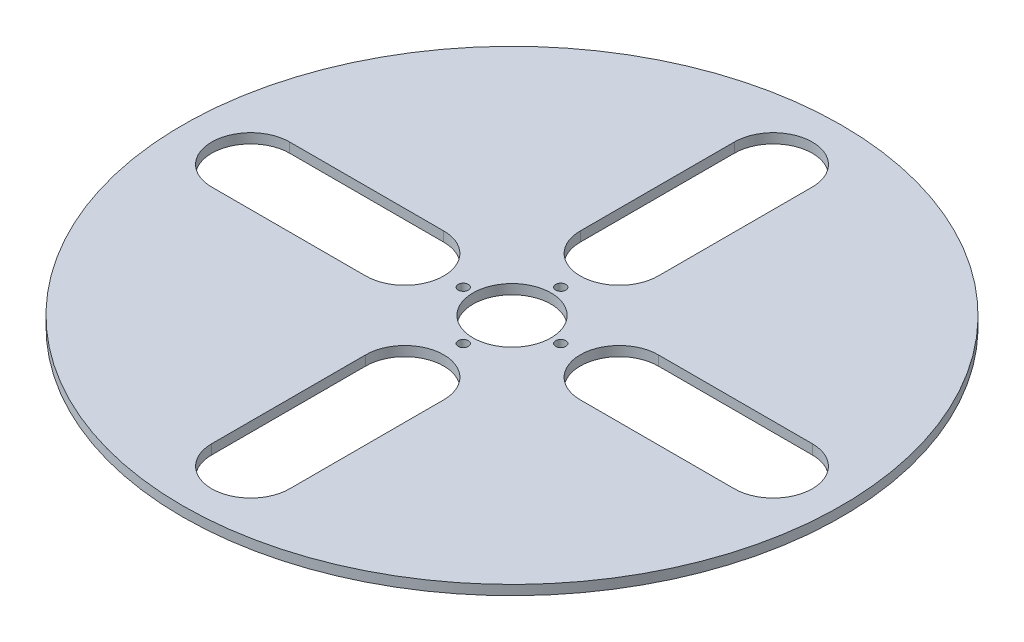
ISO-10303-21;
HEADER;
FILE_DESCRIPTION(('STEP AP214'),'2;1');
FILE_NAME('part.step','',(''),(''),'','','');
FILE_SCHEMA(('AUTOMOTIVE_DESIGN { 1 0 10303 214 1 1 1 1 }'));
ENDSEC;
DATA;
#1=APPLICATION_CONTEXT('core data for automotive mechanical design processes');
#2=APPLICATION_PROTOCOL_DEFINITION('international standard','automotive_design',2000,#1);
#3=PRODUCT_CONTEXT('',#1,'mechanical');
#4=PRODUCT('Part','Part','',(#3));
#5=PRODUCT_RELATED_PRODUCT_CATEGORY('part','',(#4));
#6=PRODUCT_DEFINITION_FORMATION('','',#4);
#7=PRODUCT_DEFINITION_CONTEXT('part definition',#1,'design');
#8=PRODUCT_DEFINITION('design','',#6,#7);
#9=PRODUCT_DEFINITION_SHAPE('','',#8);
#10=(LENGTH_UNIT() NAMED_UNIT(*) SI_UNIT(.MILLI.,.METRE.));
#11=(NAMED_UNIT(*) PLANE_ANGLE_UNIT() SI_UNIT($,.RADIAN.));
#12=(NAMED_UNIT(*) SI_UNIT($,.STERADIAN.) SOLID_ANGLE_UNIT());
#13=UNCERTAINTY_MEASURE_WITH_UNIT(LENGTH_MEASURE(1.E-05),#10,'distance_accuracy_value','');
#14=(GEOMETRIC_REPRESENTATION_CONTEXT(3) GLOBAL_UNCERTAINTY_ASSIGNED_CONTEXT((#13)) GLOBAL_UNIT_ASSIGNED_CONTEXT((#10,
#11,#12)) REPRESENTATION_CONTEXT('',''));
#15=CARTESIAN_POINT('',(0.,0.,0.));
#16=DIRECTION('',(0.,0.,1.));
#17=DIRECTION('',(1.,0.,0.));
#18=AXIS2_PLACEMENT_3D('',#15,#16,#17);
#19=CARTESIAN_POINT('',(0.,6.35,0.));
#20=DIRECTION('',(0.,-1.,0.));
#21=DIRECTION('',(0.,0.,-1.));
#22=AXIS2_PLACEMENT_3D('',#19,#20,#21);
#23=CYLINDRICAL_SURFACE('',#22,25.4);
#24=CARTESIAN_POINT('',(0.,6.35,0.));
#25=DIRECTION('',(0.,1.,0.));
#26=DIRECTION('',(0.,0.,1.));
#27=AXIS2_PLACEMENT_3D('',#24,#25,#26);
#28=CIRCLE('',#27,25.4);
#29=CARTESIAN_POINT('',(0.,6.35,25.4));
#30=VERTEX_POINT('',#29);
#31=EDGE_CURVE('E46',#30,#30,#28,.T.);
#32=ORIENTED_EDGE('',*,*,#31,.T.);
#33=EDGE_LOOP('',(#32));
#34=FACE_BOUND('',#33,.T.);
#35=CARTESIAN_POINT('',(0.,0.,0.));
#36=DIRECTION('',(0.,1.,0.));
#37=DIRECTION('',(0.,0.,1.));
#38=AXIS2_PLACEMENT_3D('',#35,#36,#37);
#39=CIRCLE('',#38,25.4);
#40=CARTESIAN_POINT('',(0.,0.,25.4));
#41=VERTEX_POINT('',#40);
#42=EDGE_CURVE('E289',#41,#41,#39,.T.);
#43=ORIENTED_EDGE('',*,*,#42,.F.);
#44=EDGE_LOOP('',(#43));
#45=FACE_BOUND('',#44,.T.);
#46=ADVANCED_FACE('F38',(#34,#45),#23,.F.);
#47=CARTESIAN_POINT('',(0.,6.35,0.));
#48=DIRECTION('',(0.,-1.,0.));
#49=DIRECTION('',(0.,0.,-1.));
#50=AXIS2_PLACEMENT_3D('',#47,#48,#49);
#51=CYLINDRICAL_SURFACE('',#50,214.63);
#52=CARTESIAN_POINT('',(0.,6.35,0.));
#53=DIRECTION('',(0.,1.,0.));
#54=DIRECTION('',(0.,0.,1.));
#55=AXIS2_PLACEMENT_3D('',#52,#53,#54);
#56=CIRCLE('',#55,214.63);
#57=CARTESIAN_POINT('',(0.,6.35,214.63));
#58=VERTEX_POINT('',#57);
#59=EDGE_CURVE('E11',#58,#58,#56,.T.);
#60=ORIENTED_EDGE('',*,*,#59,.F.);
#61=EDGE_LOOP('',(#60));
#62=FACE_BOUND('',#61,.T.);
#63=CARTESIAN_POINT('',(0.,0.,0.));
#64=DIRECTION('',(0.,1.,0.));
#65=DIRECTION('',(0.,0.,1.));
#66=AXIS2_PLACEMENT_3D('',#63,#64,#65);
#67=CIRCLE('',#66,214.63);
#68=CARTESIAN_POINT('',(0.,0.,214.63));
#69=VERTEX_POINT('',#68);
#70=EDGE_CURVE('E41',#69,#69,#67,.T.);
#71=ORIENTED_EDGE('',*,*,#70,.T.);
#72=EDGE_LOOP('',(#71));
#73=FACE_BOUND('',#72,.T.);
#74=ADVANCED_FACE('F317',(#62,#73),#51,.T.);
#75=CARTESIAN_POINT('',(0.,6.35,0.));
#76=DIRECTION('',(0.,1.,0.));
#77=DIRECTION('',(0.,0.,1.));
#78=AXIS2_PLACEMENT_3D('',#75,#76,#77);
#79=PLANE('',#78);
#80=CARTESIAN_POINT('',(0.,6.35,-170.18));
#81=DIRECTION('',(0.,1.,0.));
#82=DIRECTION('',(0.,0.,1.));
#83=AXIS2_PLACEMENT_3D('',#80,#81,#82);
#84=CIRCLE('',#83,25.4);
#85=CARTESIAN_POINT('',(25.4,6.35,-170.18));
#86=VERTEX_POINT('',#85);
#87=CARTESIAN_POINT('',(-25.4,6.35,-170.18));
#88=VERTEX_POINT('',#87);
#89=EDGE_CURVE('E54',#86,#88,#84,.T.);
#90=ORIENTED_EDGE('',*,*,#89,.F.);
#91=DIRECTION('',(0.,0.,-1.));
#92=VECTOR('',#91,1.);
#93=CARTESIAN_POINT('',(25.4,6.35,-170.18));
#94=LINE('',#93,#92);
#95=CARTESIAN_POINT('',(25.4,6.35,-69.85));
#96=VERTEX_POINT('',#95);
#97=EDGE_CURVE('E173',#96,#86,#94,.T.);
#98=ORIENTED_EDGE('',*,*,#97,.F.);
#99=CARTESIAN_POINT('',(0.,6.35,-69.85));
#100=DIRECTION('',(0.,1.,0.));
#101=DIRECTION('',(0.,0.,1.));
#102=AXIS2_PLACEMENT_3D('',#99,#100,#101);
#103=CIRCLE('',#102,25.4);
#104=CARTESIAN_POINT('',(-25.4,6.35,-69.85));
#105=VERTEX_POINT('',#104);
#106=EDGE_CURVE('E176',#105,#96,#103,.T.);
#107=ORIENTED_EDGE('',*,*,#106,.F.);
#108=DIRECTION('',(0.,0.,1.));
#109=VECTOR('',#108,1.);
#110=CARTESIAN_POINT('',(-25.4,6.35,-170.18));
#111=LINE('',#110,#109);
#112=EDGE_CURVE('E182',#88,#105,#111,.T.);
#113=ORIENTED_EDGE('',*,*,#112,.F.);
#114=EDGE_LOOP('',(#90,#98,#107,#113));
#115=FACE_BOUND('',#114,.T.);
#116=CARTESIAN_POINT('',(170.180000000005,6.35,-4.80554495202432E-12));
#117=DIRECTION('',(0.,1.,0.));
#118=DIRECTION('',(0.,0.,1.));
#119=AXIS2_PLACEMENT_3D('',#116,#117,#118);
#120=CIRCLE('',#119,25.4);
#121=CARTESIAN_POINT('',(170.180000000005,6.35,25.3999999999952));
#122=VERTEX_POINT('',#121);
#123=CARTESIAN_POINT('',(170.180000000005,6.35,-25.4000000000048));
#124=VERTEX_POINT('',#123);
#125=EDGE_CURVE('E62',#122,#124,#120,.T.);
#126=ORIENTED_EDGE('',*,*,#125,.F.);
#127=DIRECTION('',(1.,0.,0.));
#128=VECTOR('',#127,1.);
#129=CARTESIAN_POINT('',(170.180000000005,6.35,25.3999999999952));
#130=LINE('',#129,#128);
#131=CARTESIAN_POINT('',(69.8500000000048,6.35,25.3999999999952));
#132=VERTEX_POINT('',#131);
#133=EDGE_CURVE('E197',#132,#122,#130,.T.);
#134=ORIENTED_EDGE('',*,*,#133,.F.);
#135=CARTESIAN_POINT('',(69.8500000000048,6.35,-4.78711463002055E-12));
#136=DIRECTION('',(0.,1.,0.));
#137=DIRECTION('',(0.,0.,1.));
#138=AXIS2_PLACEMENT_3D('',#135,#136,#137);
#139=CIRCLE('',#138,25.4);
#140=CARTESIAN_POINT('',(69.8500000000048,6.35,-25.4000000000048));
#141=VERTEX_POINT('',#140);
#142=EDGE_CURVE('E212',#141,#132,#139,.T.);
#143=ORIENTED_EDGE('',*,*,#142,.F.);
#144=DIRECTION('',(-1.,0.,0.));
#145=VECTOR('',#144,1.);
#146=CARTESIAN_POINT('',(170.180000000005,6.35,-25.4000000000048));
#147=LINE('',#146,#145);
#148=EDGE_CURVE('E208',#124,#141,#147,.T.);
#149=ORIENTED_EDGE('',*,*,#148,.F.);
#150=EDGE_LOOP('',(#126,#134,#143,#149));
#151=FACE_BOUND('',#150,.T.);
#152=CARTESIAN_POINT('',(9.61653345907085E-12,6.35,170.18));
#153=DIRECTION('',(0.,1.,0.));
#154=DIRECTION('',(0.,0.,1.));
#155=AXIS2_PLACEMENT_3D('',#152,#153,#154);
#156=CIRCLE('',#155,25.4);
#157=CARTESIAN_POINT('',(-25.3999999999904,6.35,170.18));
#158=VERTEX_POINT('',#157);
#159=CARTESIAN_POINT('',(25.4000000000096,6.35,170.18));
#160=VERTEX_POINT('',#159);
#161=EDGE_CURVE('E237',#158,#160,#156,.T.);
#162=ORIENTED_EDGE('',*,*,#161,.F.);
#163=DIRECTION('',(0.,0.,1.));
#164=VECTOR('',#163,1.);
#165=CARTESIAN_POINT('',(-25.3999999999904,6.35,170.18));
#166=LINE('',#165,#164);
#167=CARTESIAN_POINT('',(-25.3999999999904,6.35,69.85));
#168=VERTEX_POINT('',#167);
#169=EDGE_CURVE('E227',#168,#158,#166,.T.);
#170=ORIENTED_EDGE('',*,*,#169,.F.);
#171=CARTESIAN_POINT('',(9.59195969639916E-12,6.35,69.85));
#172=DIRECTION('',(0.,1.,0.));
#173=DIRECTION('',(0.,0.,1.));
#174=AXIS2_PLACEMENT_3D('',#171,#172,#173);
#175=CIRCLE('',#174,25.4);
#176=CARTESIAN_POINT('',(25.4000000000096,6.35,69.85));
#177=VERTEX_POINT('',#176);
#178=EDGE_CURVE('E243',#177,#168,#175,.T.);
#179=ORIENTED_EDGE('',*,*,#178,.F.);
#180=DIRECTION('',(0.,0.,-1.));
#181=VECTOR('',#180,1.);
#182=CARTESIAN_POINT('',(25.4000000000096,6.35,170.18));
#183=LINE('',#182,#181);
#184=EDGE_CURVE('E239',#160,#177,#183,.T.);
#185=ORIENTED_EDGE('',*,*,#184,.F.);
#186=EDGE_LOOP('',(#162,#170,#179,#185));
#187=FACE_BOUND('',#186,.T.);
#188=CARTESIAN_POINT('',(-170.179999999995,6.35,4.78470391279643E-12));
#189=DIRECTION('',(0.,1.,0.));
#190=DIRECTION('',(0.,0.,1.));
#191=AXIS2_PLACEMENT_3D('',#188,#189,#190);
#192=CIRCLE('',#191,25.4);
#193=CARTESIAN_POINT('',(-170.179999999995,6.35,-25.3999999999952));
#194=VERTEX_POINT('',#193);
#195=CARTESIAN_POINT('',(-170.179999999995,6.35,25.4000000000048));
#196=VERTEX_POINT('',#195);
#197=EDGE_CURVE('E269',#194,#196,#192,.T.);
#198=ORIENTED_EDGE('',*,*,#197,.F.);
#199=DIRECTION('',(-1.,0.,0.));
#200=VECTOR('',#199,1.);
#201=CARTESIAN_POINT('',(-170.179999999995,6.35,-25.3999999999952));
#202=LINE('',#201,#200);
#203=CARTESIAN_POINT('',(-69.8499999999952,6.35,-25.3999999999953));
#204=VERTEX_POINT('',#203);
#205=EDGE_CURVE('E259',#204,#194,#202,.T.);
#206=ORIENTED_EDGE('',*,*,#205,.F.);
#207=CARTESIAN_POINT('',(-69.8499999999952,6.35,4.77856047212851E-12));
#208=DIRECTION('',(0.,1.,0.));
#209=DIRECTION('',(0.,0.,1.));
#210=AXIS2_PLACEMENT_3D('',#207,#208,#209);
#211=CIRCLE('',#210,25.4);
#212=CARTESIAN_POINT('',(-69.8499999999952,6.35,25.4000000000048));
#213=VERTEX_POINT('',#212);
#214=EDGE_CURVE('E274',#213,#204,#211,.T.);
#215=ORIENTED_EDGE('',*,*,#214,.F.);
#216=DIRECTION('',(1.,0.,0.));
#217=VECTOR('',#216,1.);
#218=CARTESIAN_POINT('',(-170.179999999995,6.35,25.4000000000048));
#219=LINE('',#218,#217);
#220=EDGE_CURVE('E271',#196,#213,#219,.T.);
#221=ORIENTED_EDGE('',*,*,#220,.F.);
#222=EDGE_LOOP('',(#198,#206,#215,#221));
#223=FACE_BOUND('',#222,.T.);
#224=CARTESIAN_POINT('',(0.,6.35,-31.75));
#225=DIRECTION('',(0.,1.,0.));
#226=DIRECTION('',(0.,0.,1.));
#227=AXIS2_PLACEMENT_3D('',#224,#225,#226);
#228=CIRCLE('',#227,3.2893);
#229=CARTESIAN_POINT('',(0.,6.35,-28.4607));
#230=VERTEX_POINT('',#229);
#231=EDGE_CURVE('E290',#230,#230,#228,.T.);
#232=ORIENTED_EDGE('',*,*,#231,.F.);
#233=EDGE_LOOP('',(#232));
#234=FACE_BOUND('',#233,.T.);
#235=CARTESIAN_POINT('',(31.75,6.35,1.10854532508269E-13));
#236=DIRECTION('',(0.,1.,0.));
#237=DIRECTION('',(0.,0.,1.));
#238=AXIS2_PLACEMENT_3D('',#235,#236,#237);
#239=CIRCLE('',#238,3.2893);
#240=CARTESIAN_POINT('',(31.75,6.35,3.28930000000011));
#241=VERTEX_POINT('',#240);
#242=EDGE_CURVE('E296',#241,#241,#239,.T.);
#243=ORIENTED_EDGE('',*,*,#242,.F.);
#244=EDGE_LOOP('',(#243));
#245=FACE_BOUND('',#244,.T.);
#246=CARTESIAN_POINT('',(8.90724513653449E-13,6.35,31.75));
#247=DIRECTION('',(0.,1.,0.));
#248=DIRECTION('',(0.,0.,1.));
#249=AXIS2_PLACEMENT_3D('',#246,#247,#248);
#250=CIRCLE('',#249,3.28930000000107);
#251=CARTESIAN_POINT('',(8.90724513653449E-13,6.35,35.0393000000011));
#252=VERTEX_POINT('',#251);
#253=EDGE_CURVE('E302',#252,#252,#250,.T.);
#254=ORIENTED_EDGE('',*,*,#253,.F.);
#255=EDGE_LOOP('',(#254));
#256=FACE_BOUND('',#255,.T.);
#257=CARTESIAN_POINT('',(-31.7499999999996,6.35,4.49250510414017E-13));
#258=DIRECTION('',(0.,1.,0.));
#259=DIRECTION('',(0.,0.,1.));
#260=AXIS2_PLACEMENT_3D('',#257,#258,#259);
#261=CIRCLE('',#260,3.28930000000088);
#262=CARTESIAN_POINT('',(-31.7499999999996,6.35,3.28930000000133));
#263=VERTEX_POINT('',#262);
#264=EDGE_CURVE('E189',#263,#263,#261,.T.);
#265=ORIENTED_EDGE('',*,*,#264,.F.);
#266=EDGE_LOOP('',(#265));
#267=FACE_BOUND('',#266,.T.);
#268=ORIENTED_EDGE('',*,*,#31,.F.);
#269=EDGE_LOOP('',(#268));
#270=FACE_BOUND('',#269,.T.);
#271=ORIENTED_EDGE('',*,*,#59,.T.);
#272=EDGE_LOOP('',(#271));
#273=FACE_BOUND('',#272,.T.);
#274=ADVANCED_FACE('F321',(#115,#151,#187,#223,#234,#245,#256,#267,#270,#273),#79,.T.);
#275=CARTESIAN_POINT('',(0.,0.,0.));
#276=DIRECTION('',(0.,1.,0.));
#277=DIRECTION('',(0.,0.,1.));
#278=AXIS2_PLACEMENT_3D('',#275,#276,#277);
#279=PLANE('',#278);
#280=DIRECTION('',(0.,0.,-1.));
#281=VECTOR('',#280,1.);
#282=CARTESIAN_POINT('',(25.4,0.,-170.18));
#283=LINE('',#282,#281);
#284=CARTESIAN_POINT('',(25.4,0.,-69.85));
#285=VERTEX_POINT('',#284);
#286=CARTESIAN_POINT('',(25.4,0.,-170.18));
#287=VERTEX_POINT('',#286);
#288=EDGE_CURVE('E160',#285,#287,#283,.T.);
#289=ORIENTED_EDGE('',*,*,#288,.T.);
#290=CARTESIAN_POINT('',(0.,0.,-170.18));
#291=DIRECTION('',(0.,1.,0.));
#292=DIRECTION('',(0.,0.,1.));
#293=AXIS2_PLACEMENT_3D('',#290,#291,#292);
#294=CIRCLE('',#293,25.4);
#295=CARTESIAN_POINT('',(-25.4,0.,-170.18));
#296=VERTEX_POINT('',#295);
#297=EDGE_CURVE('E154',#287,#296,#294,.T.);
#298=ORIENTED_EDGE('',*,*,#297,.T.);
#299=DIRECTION('',(0.,0.,1.));
#300=VECTOR('',#299,1.);
#301=CARTESIAN_POINT('',(-25.4,0.,-170.18));
#302=LINE('',#301,#300);
#303=CARTESIAN_POINT('',(-25.4,0.,-69.85));
#304=VERTEX_POINT('',#303);
#305=EDGE_CURVE('E164',#296,#304,#302,.T.);
#306=ORIENTED_EDGE('',*,*,#305,.T.);
#307=CARTESIAN_POINT('',(0.,0.,-69.85));
#308=DIRECTION('',(0.,1.,0.));
#309=DIRECTION('',(0.,0.,1.));
#310=AXIS2_PLACEMENT_3D('',#307,#308,#309);
#311=CIRCLE('',#310,25.4);
#312=EDGE_CURVE('E168',#304,#285,#311,.T.);
#313=ORIENTED_EDGE('',*,*,#312,.T.);
#314=EDGE_LOOP('',(#289,#298,#306,#313));
#315=FACE_BOUND('',#314,.T.);
#316=DIRECTION('',(1.,0.,0.));
#317=VECTOR('',#316,1.);
#318=CARTESIAN_POINT('',(170.180000000005,0.,25.3999999999952));
#319=LINE('',#318,#317);
#320=CARTESIAN_POINT('',(69.8500000000048,0.,25.3999999999952));
#321=VERTEX_POINT('',#320);
#322=CARTESIAN_POINT('',(170.180000000005,0.,25.3999999999952));
#323=VERTEX_POINT('',#322);
#324=EDGE_CURVE('E203',#321,#323,#319,.T.);
#325=ORIENTED_EDGE('',*,*,#324,.T.);
#326=CARTESIAN_POINT('',(170.180000000005,0.,-4.80554495202432E-12));
#327=DIRECTION('',(0.,1.,0.));
#328=DIRECTION('',(0.,0.,1.));
#329=AXIS2_PLACEMENT_3D('',#326,#327,#328);
#330=CIRCLE('',#329,25.4);
#331=CARTESIAN_POINT('',(170.180000000005,0.,-25.4000000000048));
#332=VERTEX_POINT('',#331);
#333=EDGE_CURVE('E193',#323,#332,#330,.T.);
#334=ORIENTED_EDGE('',*,*,#333,.T.);
#335=DIRECTION('',(-1.,0.,0.));
#336=VECTOR('',#335,1.);
#337=CARTESIAN_POINT('',(170.180000000005,0.,-25.4000000000048));
#338=LINE('',#337,#336);
#339=CARTESIAN_POINT('',(69.8500000000048,0.,-25.4000000000048));
#340=VERTEX_POINT('',#339);
#341=EDGE_CURVE('E196',#332,#340,#338,.T.);
#342=ORIENTED_EDGE('',*,*,#341,.T.);
#343=CARTESIAN_POINT('',(69.8500000000048,0.,-4.78711463002055E-12));
#344=DIRECTION('',(0.,1.,0.));
#345=DIRECTION('',(0.,0.,1.));
#346=AXIS2_PLACEMENT_3D('',#343,#344,#345);
#347=CIRCLE('',#346,25.4);
#348=EDGE_CURVE('E200',#340,#321,#347,.T.);
#349=ORIENTED_EDGE('',*,*,#348,.T.);
#350=EDGE_LOOP('',(#325,#334,#342,#349));
#351=FACE_BOUND('',#350,.T.);
#352=DIRECTION('',(0.,0.,1.));
#353=VECTOR('',#352,1.);
#354=CARTESIAN_POINT('',(-25.3999999999904,0.,170.18));
#355=LINE('',#354,#353);
#356=CARTESIAN_POINT('',(-25.3999999999904,0.,69.85));
#357=VERTEX_POINT('',#356);
#358=CARTESIAN_POINT('',(-25.3999999999904,0.,170.18));
#359=VERTEX_POINT('',#358);
#360=EDGE_CURVE('E233',#357,#359,#355,.T.);
#361=ORIENTED_EDGE('',*,*,#360,.T.);
#362=CARTESIAN_POINT('',(9.61653345907085E-12,0.,170.18));
#363=DIRECTION('',(0.,1.,0.));
#364=DIRECTION('',(0.,0.,1.));
#365=AXIS2_PLACEMENT_3D('',#362,#363,#364);
#366=CIRCLE('',#365,25.4);
#367=CARTESIAN_POINT('',(25.4000000000096,0.,170.18));
#368=VERTEX_POINT('',#367);
#369=EDGE_CURVE('E223',#359,#368,#366,.T.);
#370=ORIENTED_EDGE('',*,*,#369,.T.);
#371=DIRECTION('',(0.,0.,-1.));
#372=VECTOR('',#371,1.);
#373=CARTESIAN_POINT('',(25.4000000000096,0.,170.18));
#374=LINE('',#373,#372);
#375=CARTESIAN_POINT('',(25.4000000000096,0.,69.85));
#376=VERTEX_POINT('',#375);
#377=EDGE_CURVE('E226',#368,#376,#374,.T.);
#378=ORIENTED_EDGE('',*,*,#377,.T.);
#379=CARTESIAN_POINT('',(9.59195969639916E-12,0.,69.85));
#380=DIRECTION('',(0.,1.,0.));
#381=DIRECTION('',(0.,0.,1.));
#382=AXIS2_PLACEMENT_3D('',#379,#380,#381);
#383=CIRCLE('',#382,25.4);
#384=EDGE_CURVE('E230',#376,#357,#383,.T.);
#385=ORIENTED_EDGE('',*,*,#384,.T.);
#386=EDGE_LOOP('',(#361,#370,#378,#385));
#387=FACE_BOUND('',#386,.T.);
#388=DIRECTION('',(-1.,0.,0.));
#389=VECTOR('',#388,1.);
#390=CARTESIAN_POINT('',(-170.179999999995,0.,-25.3999999999952));
#391=LINE('',#390,#389);
#392=CARTESIAN_POINT('',(-69.8499999999952,0.,-25.3999999999953));
#393=VERTEX_POINT('',#392);
#394=CARTESIAN_POINT('',(-170.179999999995,0.,-25.3999999999952));
#395=VERTEX_POINT('',#394);
#396=EDGE_CURVE('E265',#393,#395,#391,.T.);
#397=ORIENTED_EDGE('',*,*,#396,.T.);
#398=CARTESIAN_POINT('',(-170.179999999995,0.,4.78470391279643E-12));
#399=DIRECTION('',(0.,1.,0.));
#400=DIRECTION('',(0.,0.,1.));
#401=AXIS2_PLACEMENT_3D('',#398,#399,#400);
#402=CIRCLE('',#401,25.4);
#403=CARTESIAN_POINT('',(-170.179999999995,0.,25.4000000000048));
#404=VERTEX_POINT('',#403);
#405=EDGE_CURVE('E255',#395,#404,#402,.T.);
#406=ORIENTED_EDGE('',*,*,#405,.T.);
#407=DIRECTION('',(1.,0.,0.));
#408=VECTOR('',#407,1.);
#409=CARTESIAN_POINT('',(-170.179999999995,0.,25.4000000000048));
#410=LINE('',#409,#408);
#411=CARTESIAN_POINT('',(-69.8499999999952,0.,25.4000000000048));
#412=VERTEX_POINT('',#411);
#413=EDGE_CURVE('E258',#404,#412,#410,.T.);
#414=ORIENTED_EDGE('',*,*,#413,.T.);
#415=CARTESIAN_POINT('',(-69.8499999999952,0.,4.77856047212851E-12));
#416=DIRECTION('',(0.,1.,0.));
#417=DIRECTION('',(0.,0.,1.));
#418=AXIS2_PLACEMENT_3D('',#415,#416,#417);
#419=CIRCLE('',#418,25.4);
#420=EDGE_CURVE('E262',#412,#393,#419,.T.);
#421=ORIENTED_EDGE('',*,*,#420,.T.);
#422=EDGE_LOOP('',(#397,#406,#414,#421));
#423=FACE_BOUND('',#422,.T.);
#424=CARTESIAN_POINT('',(0.,0.,-31.75));
#425=DIRECTION('',(0.,1.,0.));
#426=DIRECTION('',(0.,0.,1.));
#427=AXIS2_PLACEMENT_3D('',#424,#425,#426);
#428=CIRCLE('',#427,3.2893);
#429=CARTESIAN_POINT('',(0.,0.,-28.4607));
#430=VERTEX_POINT('',#429);
#431=EDGE_CURVE('E286',#430,#430,#428,.T.);
#432=ORIENTED_EDGE('',*,*,#431,.T.);
#433=EDGE_LOOP('',(#432));
#434=FACE_BOUND('',#433,.T.);
#435=CARTESIAN_POINT('',(31.75,0.,1.10854532508269E-13));
#436=DIRECTION('',(0.,1.,0.));
#437=DIRECTION('',(0.,0.,1.));
#438=AXIS2_PLACEMENT_3D('',#435,#436,#437);
#439=CIRCLE('',#438,3.2893);
#440=CARTESIAN_POINT('',(31.75,0.,3.28930000000011));
#441=VERTEX_POINT('',#440);
#442=EDGE_CURVE('E293',#441,#441,#439,.T.);
#443=ORIENTED_EDGE('',*,*,#442,.T.);
#444=EDGE_LOOP('',(#443));
#445=FACE_BOUND('',#444,.T.);
#446=CARTESIAN_POINT('',(8.90724513653449E-13,0.,31.75));
#447=DIRECTION('',(0.,1.,0.));
#448=DIRECTION('',(0.,0.,1.));
#449=AXIS2_PLACEMENT_3D('',#446,#447,#448);
#450=CIRCLE('',#449,3.28930000000107);
#451=CARTESIAN_POINT('',(8.90724513653449E-13,0.,35.0393000000011));
#452=VERTEX_POINT('',#451);
#453=EDGE_CURVE('E299',#452,#452,#450,.T.);
#454=ORIENTED_EDGE('',*,*,#453,.T.);
#455=EDGE_LOOP('',(#454));
#456=FACE_BOUND('',#455,.T.);
#457=CARTESIAN_POINT('',(-31.7499999999996,0.,4.49250510414017E-13));
#458=DIRECTION('',(0.,1.,0.));
#459=DIRECTION('',(0.,0.,1.));
#460=AXIS2_PLACEMENT_3D('',#457,#458,#459);
#461=CIRCLE('',#460,3.28930000000088);
#462=CARTESIAN_POINT('',(-31.7499999999996,0.,3.28930000000133));
#463=VERTEX_POINT('',#462);
#464=EDGE_CURVE('E305',#463,#463,#461,.T.);
#465=ORIENTED_EDGE('',*,*,#464,.T.);
#466=EDGE_LOOP('',(#465));
#467=FACE_BOUND('',#466,.T.);
#468=ORIENTED_EDGE('',*,*,#42,.T.);
#469=EDGE_LOOP('',(#468));
#470=FACE_BOUND('',#469,.T.);
#471=ORIENTED_EDGE('',*,*,#70,.F.);
#472=EDGE_LOOP('',(#471));
#473=FACE_BOUND('',#472,.T.);
#474=ADVANCED_FACE('F170',(#315,#351,#387,#423,#434,#445,#456,#467,#470,#473),#279,.F.);
#475=CARTESIAN_POINT('',(-31.7499999999996,0.,4.49250510414017E-13));
#476=DIRECTION('',(0.,1.,0.));
#477=DIRECTION('',(0.,0.,1.));
#478=AXIS2_PLACEMENT_3D('',#475,#476,#477);
#479=CYLINDRICAL_SURFACE('',#478,3.28930000000088);
#480=ORIENTED_EDGE('',*,*,#464,.F.);
#481=EDGE_LOOP('',(#480));
#482=FACE_BOUND('',#481,.T.);
#483=ORIENTED_EDGE('',*,*,#264,.T.);
#484=EDGE_LOOP('',(#483));
#485=FACE_BOUND('',#484,.T.);
#486=ADVANCED_FACE('F320',(#482,#485),#479,.F.);
#487=CARTESIAN_POINT('',(8.90724513653449E-13,0.,31.75));
#488=DIRECTION('',(0.,1.,0.));
#489=DIRECTION('',(0.,0.,1.));
#490=AXIS2_PLACEMENT_3D('',#487,#488,#489);
#491=CYLINDRICAL_SURFACE('',#490,3.28930000000107);
#492=ORIENTED_EDGE('',*,*,#453,.F.);
#493=EDGE_LOOP('',(#492));
#494=FACE_BOUND('',#493,.T.);
#495=ORIENTED_EDGE('',*,*,#253,.T.);
#496=EDGE_LOOP('',(#495));
#497=FACE_BOUND('',#496,.T.);
#498=ADVANCED_FACE('F327',(#494,#497),#491,.F.);
#499=CARTESIAN_POINT('',(31.75,0.,1.10854532508269E-13));
#500=DIRECTION('',(0.,1.,0.));
#501=DIRECTION('',(0.,0.,1.));
#502=AXIS2_PLACEMENT_3D('',#499,#500,#501);
#503=CYLINDRICAL_SURFACE('',#502,3.2893);
#504=ORIENTED_EDGE('',*,*,#442,.F.);
#505=EDGE_LOOP('',(#504));
#506=FACE_BOUND('',#505,.T.);
#507=ORIENTED_EDGE('',*,*,#242,.T.);
#508=EDGE_LOOP('',(#507));
#509=FACE_BOUND('',#508,.T.);
#510=ADVANCED_FACE('F522',(#506,#509),#503,.F.);
#511=CARTESIAN_POINT('',(0.,0.,-31.75));
#512=DIRECTION('',(0.,1.,0.));
#513=DIRECTION('',(0.,0.,1.));
#514=AXIS2_PLACEMENT_3D('',#511,#512,#513);
#515=CYLINDRICAL_SURFACE('',#514,3.2893);
#516=ORIENTED_EDGE('',*,*,#431,.F.);
#517=EDGE_LOOP('',(#516));
#518=FACE_BOUND('',#517,.T.);
#519=ORIENTED_EDGE('',*,*,#231,.T.);
#520=EDGE_LOOP('',(#519));
#521=FACE_BOUND('',#520,.T.);
#522=ADVANCED_FACE('F356',(#518,#521),#515,.F.);
#523=CARTESIAN_POINT('',(-170.179999999995,0.,4.78470391279643E-12));
#524=DIRECTION('',(0.,1.,0.));
#525=DIRECTION('',(0.,0.,1.));
#526=AXIS2_PLACEMENT_3D('',#523,#524,#525);
#527=CYLINDRICAL_SURFACE('',#526,25.4);
#528=ORIENTED_EDGE('',*,*,#197,.T.);
#529=DIRECTION('',(0.,1.,0.));
#530=VECTOR('',#529,1.);
#531=CARTESIAN_POINT('',(-170.179999999995,0.,25.4000000000048));
#532=LINE('',#531,#530);
#533=EDGE_CURVE('E268',#404,#196,#532,.T.);
#534=ORIENTED_EDGE('',*,*,#533,.F.);
#535=ORIENTED_EDGE('',*,*,#405,.F.);
#536=DIRECTION('',(0.,1.,0.));
#537=VECTOR('',#536,1.);
#538=CARTESIAN_POINT('',(-170.179999999995,0.,-25.3999999999952));
#539=LINE('',#538,#537);
#540=EDGE_CURVE('E240',#395,#194,#539,.T.);
#541=ORIENTED_EDGE('',*,*,#540,.T.);
#542=EDGE_LOOP('',(#528,#534,#535,#541));
#543=FACE_BOUND('',#542,.T.);
#544=ADVANCED_FACE('F366',(#543),#527,.F.);
#545=CARTESIAN_POINT('',(-170.179999999995,0.,-25.3999999999952));
#546=DIRECTION('',(0.,0.,-1.));
#547=DIRECTION('',(-1.,0.,0.));
#548=AXIS2_PLACEMENT_3D('',#545,#546,#547);
#549=PLANE('',#548);
#550=ORIENTED_EDGE('',*,*,#205,.T.);
#551=ORIENTED_EDGE('',*,*,#540,.F.);
#552=ORIENTED_EDGE('',*,*,#396,.F.);
#553=DIRECTION('',(0.,1.,0.));
#554=VECTOR('',#553,1.);
#555=CARTESIAN_POINT('',(-69.8499999999952,0.,-25.3999999999953));
#556=LINE('',#555,#554);
#557=EDGE_CURVE('E280',#393,#204,#556,.T.);
#558=ORIENTED_EDGE('',*,*,#557,.T.);
#559=EDGE_LOOP('',(#550,#551,#552,#558));
#560=FACE_BOUND('',#559,.T.);
#561=ADVANCED_FACE('F371',(#560),#549,.F.);
#562=CARTESIAN_POINT('',(-69.8499999999952,0.,4.77856047212851E-12));
#563=DIRECTION('',(0.,1.,0.));
#564=DIRECTION('',(0.,0.,1.));
#565=AXIS2_PLACEMENT_3D('',#562,#563,#564);
#566=CYLINDRICAL_SURFACE('',#565,25.4);
#567=ORIENTED_EDGE('',*,*,#214,.T.);
#568=ORIENTED_EDGE('',*,*,#557,.F.);
#569=ORIENTED_EDGE('',*,*,#420,.F.);
#570=DIRECTION('',(0.,1.,0.));
#571=VECTOR('',#570,1.);
#572=CARTESIAN_POINT('',(-69.8499999999952,0.,25.4000000000048));
#573=LINE('',#572,#571);
#574=EDGE_CURVE('E282',#412,#213,#573,.T.);
#575=ORIENTED_EDGE('',*,*,#574,.T.);
#576=EDGE_LOOP('',(#567,#568,#569,#575));
#577=FACE_BOUND('',#576,.T.);
#578=ADVANCED_FACE('F381',(#577),#566,.F.);
#579=CARTESIAN_POINT('',(-170.179999999995,0.,25.4000000000048));
#580=DIRECTION('',(0.,0.,1.));
#581=DIRECTION('',(1.,0.,0.));
#582=AXIS2_PLACEMENT_3D('',#579,#580,#581);
#583=PLANE('',#582);
#584=ORIENTED_EDGE('',*,*,#220,.T.);
#585=ORIENTED_EDGE('',*,*,#574,.F.);
#586=ORIENTED_EDGE('',*,*,#413,.F.);
#587=ORIENTED_EDGE('',*,*,#533,.T.);
#588=EDGE_LOOP('',(#584,#585,#586,#587));
#589=FACE_BOUND('',#588,.T.);
#590=ADVANCED_FACE('F391',(#589),#583,.F.);
#591=CARTESIAN_POINT('',(9.61653345907085E-12,0.,170.18));
#592=DIRECTION('',(0.,1.,0.));
#593=DIRECTION('',(0.,0.,1.));
#594=AXIS2_PLACEMENT_3D('',#591,#592,#593);
#595=CYLINDRICAL_SURFACE('',#594,25.4);
#596=ORIENTED_EDGE('',*,*,#161,.T.);
#597=DIRECTION('',(0.,1.,0.));
#598=VECTOR('',#597,1.);
#599=CARTESIAN_POINT('',(25.4000000000096,0.,170.18));
#600=LINE('',#599,#598);
#601=EDGE_CURVE('E236',#368,#160,#600,.T.);
#602=ORIENTED_EDGE('',*,*,#601,.F.);
#603=ORIENTED_EDGE('',*,*,#369,.F.);
#604=DIRECTION('',(0.,1.,0.));
#605=VECTOR('',#604,1.);
#606=CARTESIAN_POINT('',(-25.3999999999904,0.,170.18));
#607=LINE('',#606,#605);
#608=EDGE_CURVE('E209',#359,#158,#607,.T.);
#609=ORIENTED_EDGE('',*,*,#608,.T.);
#610=EDGE_LOOP('',(#596,#602,#603,#609));
#611=FACE_BOUND('',#610,.T.);
#612=ADVANCED_FACE('F401',(#611),#595,.F.);
#613=CARTESIAN_POINT('',(-25.3999999999904,0.,170.18));
#614=DIRECTION('',(-1.,0.,0.));
#615=DIRECTION('',(0.,0.,1.));
#616=AXIS2_PLACEMENT_3D('',#613,#614,#615);
#617=PLANE('',#616);
#618=ORIENTED_EDGE('',*,*,#169,.T.);
#619=ORIENTED_EDGE('',*,*,#608,.F.);
#620=ORIENTED_EDGE('',*,*,#360,.F.);
#621=DIRECTION('',(0.,1.,0.));
#622=VECTOR('',#621,1.);
#623=CARTESIAN_POINT('',(-25.3999999999904,0.,69.85));
#624=LINE('',#623,#622);
#625=EDGE_CURVE('E249',#357,#168,#624,.T.);
#626=ORIENTED_EDGE('',*,*,#625,.T.);
#627=EDGE_LOOP('',(#618,#619,#620,#626));
#628=FACE_BOUND('',#627,.T.);
#629=ADVANCED_FACE('F411',(#628),#617,.F.);
#630=CARTESIAN_POINT('',(9.59195969639916E-12,0.,69.85));
#631=DIRECTION('',(0.,1.,0.));
#632=DIRECTION('',(0.,0.,1.));
#633=AXIS2_PLACEMENT_3D('',#630,#631,#632);
#634=CYLINDRICAL_SURFACE('',#633,25.4);
#635=ORIENTED_EDGE('',*,*,#178,.T.);
#636=ORIENTED_EDGE('',*,*,#625,.F.);
#637=ORIENTED_EDGE('',*,*,#384,.F.);
#638=DIRECTION('',(0.,1.,0.));
#639=VECTOR('',#638,1.);
#640=CARTESIAN_POINT('',(25.4000000000096,0.,69.85));
#641=LINE('',#640,#639);
#642=EDGE_CURVE('E251',#376,#177,#641,.T.);
#643=ORIENTED_EDGE('',*,*,#642,.T.);
#644=EDGE_LOOP('',(#635,#636,#637,#643));
#645=FACE_BOUND('',#644,.T.);
#646=ADVANCED_FACE('F421',(#645),#634,.F.);
#647=CARTESIAN_POINT('',(25.4000000000096,0.,170.18));
#648=DIRECTION('',(1.,0.,0.));
#649=DIRECTION('',(0.,0.,-1.));
#650=AXIS2_PLACEMENT_3D('',#647,#648,#649);
#651=PLANE('',#650);
#652=ORIENTED_EDGE('',*,*,#184,.T.);
#653=ORIENTED_EDGE('',*,*,#642,.F.);
#654=ORIENTED_EDGE('',*,*,#377,.F.);
#655=ORIENTED_EDGE('',*,*,#601,.T.);
#656=EDGE_LOOP('',(#652,#653,#654,#655));
#657=FACE_BOUND('',#656,.T.);
#658=ADVANCED_FACE('F431',(#657),#651,.F.);
#659=CARTESIAN_POINT('',(170.180000000005,0.,-4.80554495202432E-12));
#660=DIRECTION('',(0.,1.,0.));
#661=DIRECTION('',(0.,0.,1.));
#662=AXIS2_PLACEMENT_3D('',#659,#660,#661);
#663=CYLINDRICAL_SURFACE('',#662,25.4);
#664=ORIENTED_EDGE('',*,*,#125,.T.);
#665=DIRECTION('',(0.,1.,0.));
#666=VECTOR('',#665,1.);
#667=CARTESIAN_POINT('',(170.180000000005,0.,-25.4000000000048));
#668=LINE('',#667,#666);
#669=EDGE_CURVE('E206',#332,#124,#668,.T.);
#670=ORIENTED_EDGE('',*,*,#669,.F.);
#671=ORIENTED_EDGE('',*,*,#333,.F.);
#672=DIRECTION('',(0.,1.,0.));
#673=VECTOR('',#672,1.);
#674=CARTESIAN_POINT('',(170.180000000005,0.,25.3999999999952));
#675=LINE('',#674,#673);
#676=EDGE_CURVE('E183',#323,#122,#675,.T.);
#677=ORIENTED_EDGE('',*,*,#676,.T.);
#678=EDGE_LOOP('',(#664,#670,#671,#677));
#679=FACE_BOUND('',#678,.T.);
#680=ADVANCED_FACE('F441',(#679),#663,.F.);
#681=CARTESIAN_POINT('',(170.180000000005,0.,25.3999999999952));
#682=DIRECTION('',(0.,0.,1.));
#683=DIRECTION('',(1.,0.,0.));
#684=AXIS2_PLACEMENT_3D('',#681,#682,#683);
#685=PLANE('',#684);
#686=ORIENTED_EDGE('',*,*,#133,.T.);
#687=ORIENTED_EDGE('',*,*,#676,.F.);
#688=ORIENTED_EDGE('',*,*,#324,.F.);
#689=DIRECTION('',(0.,1.,0.));
#690=VECTOR('',#689,1.);
#691=CARTESIAN_POINT('',(69.8500000000048,0.,25.3999999999952));
#692=LINE('',#691,#690);
#693=EDGE_CURVE('E218',#321,#132,#692,.T.);
#694=ORIENTED_EDGE('',*,*,#693,.T.);
#695=EDGE_LOOP('',(#686,#687,#688,#694));
#696=FACE_BOUND('',#695,.T.);
#697=ADVANCED_FACE('F451',(#696),#685,.F.);
#698=CARTESIAN_POINT('',(69.8500000000048,0.,-4.78711463002055E-12));
#699=DIRECTION('',(0.,1.,0.));
#700=DIRECTION('',(0.,0.,1.));
#701=AXIS2_PLACEMENT_3D('',#698,#699,#700);
#702=CYLINDRICAL_SURFACE('',#701,25.4);
#703=ORIENTED_EDGE('',*,*,#142,.T.);
#704=ORIENTED_EDGE('',*,*,#693,.F.);
#705=ORIENTED_EDGE('',*,*,#348,.F.);
#706=DIRECTION('',(0.,1.,0.));
#707=VECTOR('',#706,1.);
#708=CARTESIAN_POINT('',(69.8500000000048,0.,-25.4000000000048));
#709=LINE('',#708,#707);
#710=EDGE_CURVE('E220',#340,#141,#709,.T.);
#711=ORIENTED_EDGE('',*,*,#710,.T.);
#712=EDGE_LOOP('',(#703,#704,#705,#711));
#713=FACE_BOUND('',#712,.T.);
#714=ADVANCED_FACE('F460',(#713),#702,.F.);
#715=CARTESIAN_POINT('',(170.180000000005,0.,-25.4000000000048));
#716=DIRECTION('',(0.,0.,-1.));
#717=DIRECTION('',(-1.,0.,0.));
#718=AXIS2_PLACEMENT_3D('',#715,#716,#717);
#719=PLANE('',#718);
#720=ORIENTED_EDGE('',*,*,#148,.T.);
#721=ORIENTED_EDGE('',*,*,#710,.F.);
#722=ORIENTED_EDGE('',*,*,#341,.F.);
#723=ORIENTED_EDGE('',*,*,#669,.T.);
#724=EDGE_LOOP('',(#720,#721,#722,#723));
#725=FACE_BOUND('',#724,.T.);
#726=ADVANCED_FACE('F470',(#725),#719,.F.);
#727=CARTESIAN_POINT('',(0.,0.,-170.18));
#728=DIRECTION('',(0.,1.,0.));
#729=DIRECTION('',(0.,0.,1.));
#730=AXIS2_PLACEMENT_3D('',#727,#728,#729);
#731=CYLINDRICAL_SURFACE('',#730,25.4);
#732=ORIENTED_EDGE('',*,*,#89,.T.);
#733=DIRECTION('',(0.,1.,0.));
#734=VECTOR('',#733,1.);
#735=CARTESIAN_POINT('',(-25.4,0.,-170.18));
#736=LINE('',#735,#734);
#737=EDGE_CURVE('E150',#296,#88,#736,.T.);
#738=ORIENTED_EDGE('',*,*,#737,.F.);
#739=ORIENTED_EDGE('',*,*,#297,.F.);
#740=DIRECTION('',(0.,1.,0.));
#741=VECTOR('',#740,1.);
#742=CARTESIAN_POINT('',(25.4,0.,-170.18));
#743=LINE('',#742,#741);
#744=EDGE_CURVE('E187',#287,#86,#743,.T.);
#745=ORIENTED_EDGE('',*,*,#744,.T.);
#746=EDGE_LOOP('',(#732,#738,#739,#745));
#747=FACE_BOUND('',#746,.T.);
#748=ADVANCED_FACE('F152',(#747),#731,.F.);
#749=CARTESIAN_POINT('',(25.4,0.,-170.18));
#750=DIRECTION('',(1.,0.,0.));
#751=DIRECTION('',(0.,0.,-1.));
#752=AXIS2_PLACEMENT_3D('',#749,#750,#751);
#753=PLANE('',#752);
#754=ORIENTED_EDGE('',*,*,#97,.T.);
#755=ORIENTED_EDGE('',*,*,#744,.F.);
#756=ORIENTED_EDGE('',*,*,#288,.F.);
#757=DIRECTION('',(0.,1.,0.));
#758=VECTOR('',#757,1.);
#759=CARTESIAN_POINT('',(25.4,0.,-69.85));
#760=LINE('',#759,#758);
#761=EDGE_CURVE('E190',#285,#96,#760,.T.);
#762=ORIENTED_EDGE('',*,*,#761,.T.);
#763=EDGE_LOOP('',(#754,#755,#756,#762));
#764=FACE_BOUND('',#763,.T.);
#765=ADVANCED_FACE('F489',(#764),#753,.F.);
#766=CARTESIAN_POINT('',(0.,0.,-69.85));
#767=DIRECTION('',(0.,1.,0.));
#768=DIRECTION('',(0.,0.,1.));
#769=AXIS2_PLACEMENT_3D('',#766,#767,#768);
#770=CYLINDRICAL_SURFACE('',#769,25.4);
#771=ORIENTED_EDGE('',*,*,#106,.T.);
#772=ORIENTED_EDGE('',*,*,#761,.F.);
#773=ORIENTED_EDGE('',*,*,#312,.F.);
#774=DIRECTION('',(0.,1.,0.));
#775=VECTOR('',#774,1.);
#776=CARTESIAN_POINT('',(-25.4,0.,-69.85));
#777=LINE('',#776,#775);
#778=EDGE_CURVE('E159',#304,#105,#777,.T.);
#779=ORIENTED_EDGE('',*,*,#778,.T.);
#780=EDGE_LOOP('',(#771,#772,#773,#779));
#781=FACE_BOUND('',#780,.T.);
#782=ADVANCED_FACE('F498',(#781),#770,.F.);
#783=CARTESIAN_POINT('',(-25.4,0.,-170.18));
#784=DIRECTION('',(-1.,0.,0.));
#785=DIRECTION('',(0.,0.,1.));
#786=AXIS2_PLACEMENT_3D('',#783,#784,#785);
#787=PLANE('',#786);
#788=ORIENTED_EDGE('',*,*,#112,.T.);
#789=ORIENTED_EDGE('',*,*,#778,.F.);
#790=ORIENTED_EDGE('',*,*,#305,.F.);
#791=ORIENTED_EDGE('',*,*,#737,.T.);
#792=EDGE_LOOP('',(#788,#789,#790,#791));
#793=FACE_BOUND('',#792,.T.);
#794=ADVANCED_FACE('F165',(#793),#787,.F.);
#795=CLOSED_SHELL('',(#46,#74,#274,#474,#486,#498,#510,#522,#544,#561,#578,#590,#612,#629,#646,
#658,#680,#697,#714,#726,#748,#765,#782,#794));
#796=MANIFOLD_SOLID_BREP('B2',#795);
#797=ADVANCED_BREP_SHAPE_REPRESENTATION('',(#18,#796),#14);
#798=SHAPE_DEFINITION_REPRESENTATION(#9,#797);
ENDSEC;
END-ISO-10303-21;
